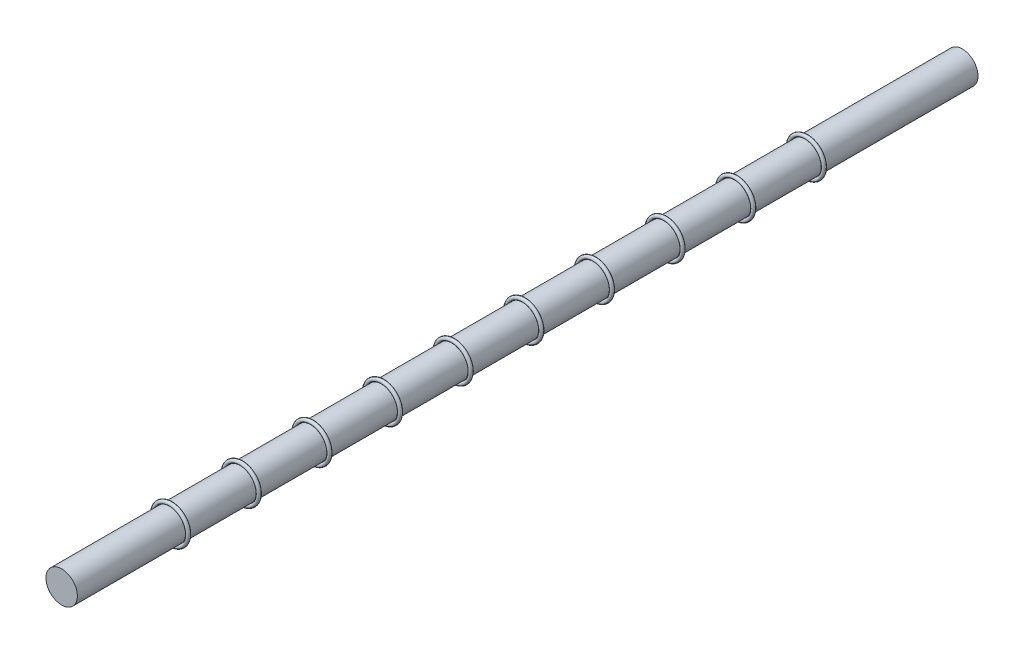
ISO-10303-21;
HEADER;
FILE_DESCRIPTION(('STEP AP214'),'2;1');
FILE_NAME('part.step','',(''),(''),'','','');
FILE_SCHEMA(('AUTOMOTIVE_DESIGN { 1 0 10303 214 1 1 1 1 }'));
ENDSEC;
DATA;
#1=APPLICATION_CONTEXT('core data for automotive mechanical design processes');
#2=APPLICATION_PROTOCOL_DEFINITION('international standard','automotive_design',2000,#1);
#3=PRODUCT_CONTEXT('',#1,'mechanical');
#4=PRODUCT('Part','Part','',(#3));
#5=PRODUCT_RELATED_PRODUCT_CATEGORY('part','',(#4));
#6=PRODUCT_DEFINITION_FORMATION('','',#4);
#7=PRODUCT_DEFINITION_CONTEXT('part definition',#1,'design');
#8=PRODUCT_DEFINITION('design','',#6,#7);
#9=PRODUCT_DEFINITION_SHAPE('','',#8);
#10=(LENGTH_UNIT() NAMED_UNIT(*) SI_UNIT(.MILLI.,.METRE.));
#11=(NAMED_UNIT(*) PLANE_ANGLE_UNIT() SI_UNIT($,.RADIAN.));
#12=(NAMED_UNIT(*) SI_UNIT($,.STERADIAN.) SOLID_ANGLE_UNIT());
#13=UNCERTAINTY_MEASURE_WITH_UNIT(LENGTH_MEASURE(1.E-05),#10,'distance_accuracy_value','');
#14=(GEOMETRIC_REPRESENTATION_CONTEXT(3) GLOBAL_UNCERTAINTY_ASSIGNED_CONTEXT((#13)) GLOBAL_UNIT_ASSIGNED_CONTEXT((#10,
#11,#12)) REPRESENTATION_CONTEXT('',''));
#15=CARTESIAN_POINT('',(0.,0.,0.));
#16=DIRECTION('',(0.,0.,1.));
#17=DIRECTION('',(1.,0.,0.));
#18=AXIS2_PLACEMENT_3D('',#15,#16,#17);
#19=CARTESIAN_POINT('',(0.,0.,39.75));
#20=DIRECTION('',(0.,0.,1.));
#21=DIRECTION('',(1.,0.,0.));
#22=AXIS2_PLACEMENT_3D('',#19,#20,#21);
#23=TOROIDAL_SURFACE('',#22,4.47282999999944,0.47283);
#24=CARTESIAN_POINT('',(4.94565999999944,0.,39.75));
#25=VERTEX_POINT('',#24);
#26=VERTEX_LOOP('',#25);
#27=FACE_BOUND('',#26,.T.);
#28=ADVANCED_FACE('F37',(#27),#23,.T.);
#29=CLOSED_SHELL('',(#28));
#30=MANIFOLD_SOLID_BREP('B2',#29);
#31=CARTESIAN_POINT('',(0.,0.,57.75));
#32=DIRECTION('',(0.,0.,1.));
#33=DIRECTION('',(1.,0.,0.));
#34=AXIS2_PLACEMENT_3D('',#31,#32,#33);
#35=TOROIDAL_SURFACE('',#34,4.47282999999951,0.47283);
#36=CARTESIAN_POINT('',(4.94565999999951,0.,57.75));
#37=VERTEX_POINT('',#36);
#38=VERTEX_LOOP('',#37);
#39=FACE_BOUND('',#38,.T.);
#40=ADVANCED_FACE('F55',(#39),#35,.T.);
#41=CLOSED_SHELL('',(#40));
#42=MANIFOLD_SOLID_BREP('B6',#41);
#43=CARTESIAN_POINT('',(0.,0.,75.75));
#44=DIRECTION('',(0.,0.,1.));
#45=DIRECTION('',(1.,0.,0.));
#46=AXIS2_PLACEMENT_3D('',#43,#44,#45);
#47=TOROIDAL_SURFACE('',#46,4.47282999999957,0.472829999999998);
#48=CARTESIAN_POINT('',(4.94565999999957,0.,75.75));
#49=VERTEX_POINT('',#48);
#50=VERTEX_LOOP('',#49);
#51=FACE_BOUND('',#50,.T.);
#52=ADVANCED_FACE('F73',(#51),#47,.T.);
#53=CLOSED_SHELL('',(#52));
#54=MANIFOLD_SOLID_BREP('B33',#53);
#55=CARTESIAN_POINT('',(0.,0.,93.75));
#56=DIRECTION('',(0.,0.,1.));
#57=DIRECTION('',(1.,0.,0.));
#58=AXIS2_PLACEMENT_3D('',#55,#56,#57);
#59=TOROIDAL_SURFACE('',#58,4.47282999999963,0.472829999999998);
#60=CARTESIAN_POINT('',(4.94565999999963,0.,93.75));
#61=VERTEX_POINT('',#60);
#62=VERTEX_LOOP('',#61);
#63=FACE_BOUND('',#62,.T.);
#64=ADVANCED_FACE('F91',(#63),#59,.T.);
#65=CLOSED_SHELL('',(#64));
#66=MANIFOLD_SOLID_BREP('B51',#65);
#67=CARTESIAN_POINT('',(0.,0.,111.75));
#68=DIRECTION('',(0.,0.,1.));
#69=DIRECTION('',(1.,0.,0.));
#70=AXIS2_PLACEMENT_3D('',#67,#68,#69);
#71=TOROIDAL_SURFACE('',#70,4.47282999999969,0.472829999999998);
#72=CARTESIAN_POINT('',(4.94565999999969,0.,111.75));
#73=VERTEX_POINT('',#72);
#74=VERTEX_LOOP('',#73);
#75=FACE_BOUND('',#74,.T.);
#76=ADVANCED_FACE('F109',(#75),#71,.T.);
#77=CLOSED_SHELL('',(#76));
#78=MANIFOLD_SOLID_BREP('B69',#77);
#79=CARTESIAN_POINT('',(0.,0.,129.75));
#80=DIRECTION('',(0.,0.,1.));
#81=DIRECTION('',(1.,0.,0.));
#82=AXIS2_PLACEMENT_3D('',#79,#80,#81);
#83=TOROIDAL_SURFACE('',#82,4.47282999999975,0.472830000000002);
#84=CARTESIAN_POINT('',(4.94565999999976,0.,129.75));
#85=VERTEX_POINT('',#84);
#86=VERTEX_LOOP('',#85);
#87=FACE_BOUND('',#86,.T.);
#88=ADVANCED_FACE('F127',(#87),#83,.T.);
#89=CLOSED_SHELL('',(#88));
#90=MANIFOLD_SOLID_BREP('B87',#89);
#91=CARTESIAN_POINT('',(0.,0.,147.75));
#92=DIRECTION('',(0.,0.,1.));
#93=DIRECTION('',(1.,0.,0.));
#94=AXIS2_PLACEMENT_3D('',#91,#92,#93);
#95=TOROIDAL_SURFACE('',#94,4.47282999999981,0.472830000000002);
#96=CARTESIAN_POINT('',(4.94565999999982,0.,147.75));
#97=VERTEX_POINT('',#96);
#98=VERTEX_LOOP('',#97);
#99=FACE_BOUND('',#98,.T.);
#100=ADVANCED_FACE('F145',(#99),#95,.T.);
#101=CLOSED_SHELL('',(#100));
#102=MANIFOLD_SOLID_BREP('B105',#101);
#103=CARTESIAN_POINT('',(0.,0.,165.75));
#104=DIRECTION('',(0.,0.,1.));
#105=DIRECTION('',(1.,0.,0.));
#106=AXIS2_PLACEMENT_3D('',#103,#104,#105);
#107=TOROIDAL_SURFACE('',#106,4.47282999999988,0.472830000000002);
#108=CARTESIAN_POINT('',(4.94565999999988,0.,165.75));
#109=VERTEX_POINT('',#108);
#110=VERTEX_LOOP('',#109);
#111=FACE_BOUND('',#110,.T.);
#112=ADVANCED_FACE('F163',(#111),#107,.T.);
#113=CLOSED_SHELL('',(#112));
#114=MANIFOLD_SOLID_BREP('B123',#113);
#115=CARTESIAN_POINT('',(0.,0.,183.75));
#116=DIRECTION('',(0.,0.,1.));
#117=DIRECTION('',(1.,0.,0.));
#118=AXIS2_PLACEMENT_3D('',#115,#116,#117);
#119=TOROIDAL_SURFACE('',#118,4.47282999999994,0.472830000000002);
#120=CARTESIAN_POINT('',(4.94565999999994,0.,183.75));
#121=VERTEX_POINT('',#120);
#122=VERTEX_LOOP('',#121);
#123=FACE_BOUND('',#122,.T.);
#124=ADVANCED_FACE('F181',(#123),#119,.T.);
#125=CLOSED_SHELL('',(#124));
#126=MANIFOLD_SOLID_BREP('B141',#125);
#127=CARTESIAN_POINT('',(0.,0.,201.75));
#128=DIRECTION('',(0.,0.,1.));
#129=DIRECTION('',(1.,0.,0.));
#130=AXIS2_PLACEMENT_3D('',#127,#128,#129);
#131=TOROIDAL_SURFACE('',#130,4.47283,0.472830000000002);
#132=CARTESIAN_POINT('',(4.94566,0.,201.75));
#133=VERTEX_POINT('',#132);
#134=VERTEX_LOOP('',#133);
#135=FACE_BOUND('',#134,.T.);
#136=ADVANCED_FACE('F200',(#135),#131,.T.);
#137=CLOSED_SHELL('',(#136));
#138=MANIFOLD_SOLID_BREP('B159',#137);
#139=CARTESIAN_POINT('',(0.,0.,229.5));
#140=DIRECTION('',(0.,0.,-1.));
#141=DIRECTION('',(-1.,0.,0.));
#142=AXIS2_PLACEMENT_3D('',#139,#140,#141);
#143=CYLINDRICAL_SURFACE('',#142,4.);
#144=CARTESIAN_POINT('',(0.,0.,229.5));
#145=DIRECTION('',(0.,0.,1.));
#146=DIRECTION('',(1.,0.,0.));
#147=AXIS2_PLACEMENT_3D('',#144,#145,#146);
#148=CIRCLE('',#147,4.);
#149=CARTESIAN_POINT('',(4.,0.,229.5));
#150=VERTEX_POINT('',#149);
#151=EDGE_CURVE('E199',#150,#150,#148,.T.);
#152=ORIENTED_EDGE('',*,*,#151,.F.);
#153=EDGE_LOOP('',(#152));
#154=FACE_BOUND('',#153,.T.);
#155=CARTESIAN_POINT('',(0.,0.,0.));
#156=DIRECTION('',(0.,0.,1.));
#157=DIRECTION('',(1.,0.,0.));
#158=AXIS2_PLACEMENT_3D('',#155,#156,#157);
#159=CIRCLE('',#158,4.);
#160=CARTESIAN_POINT('',(4.,0.,0.));
#161=VERTEX_POINT('',#160);
#162=EDGE_CURVE('E215',#161,#161,#159,.T.);
#163=ORIENTED_EDGE('',*,*,#162,.T.);
#164=EDGE_LOOP('',(#163));
#165=FACE_BOUND('',#164,.T.);
#166=ADVANCED_FACE('F212',(#154,#165),#143,.T.);
#167=CARTESIAN_POINT('',(0.,0.,229.5));
#168=DIRECTION('',(0.,0.,1.));
#169=DIRECTION('',(1.,0.,0.));
#170=AXIS2_PLACEMENT_3D('',#167,#168,#169);
#171=PLANE('',#170);
#172=ORIENTED_EDGE('',*,*,#151,.T.);
#173=EDGE_LOOP('',(#172));
#174=FACE_BOUND('',#173,.T.);
#175=ADVANCED_FACE('F227',(#174),#171,.T.);
#176=CARTESIAN_POINT('',(0.,0.,0.));
#177=DIRECTION('',(0.,0.,1.));
#178=DIRECTION('',(1.,0.,0.));
#179=AXIS2_PLACEMENT_3D('',#176,#177,#178);
#180=PLANE('',#179);
#181=ORIENTED_EDGE('',*,*,#162,.F.);
#182=EDGE_LOOP('',(#181));
#183=FACE_BOUND('',#182,.T.);
#184=ADVANCED_FACE('F225',(#183),#180,.F.);
#185=CLOSED_SHELL('',(#166,#175,#184));
#186=MANIFOLD_SOLID_BREP('B177',#185);
#187=ADVANCED_BREP_SHAPE_REPRESENTATION('',(#18,#30,#42,#54,#66,#78,#90,#102,#114,#126,#138,
#186),#14);
#188=SHAPE_DEFINITION_REPRESENTATION(#9,#187);
ENDSEC;
END-ISO-10303-21;
